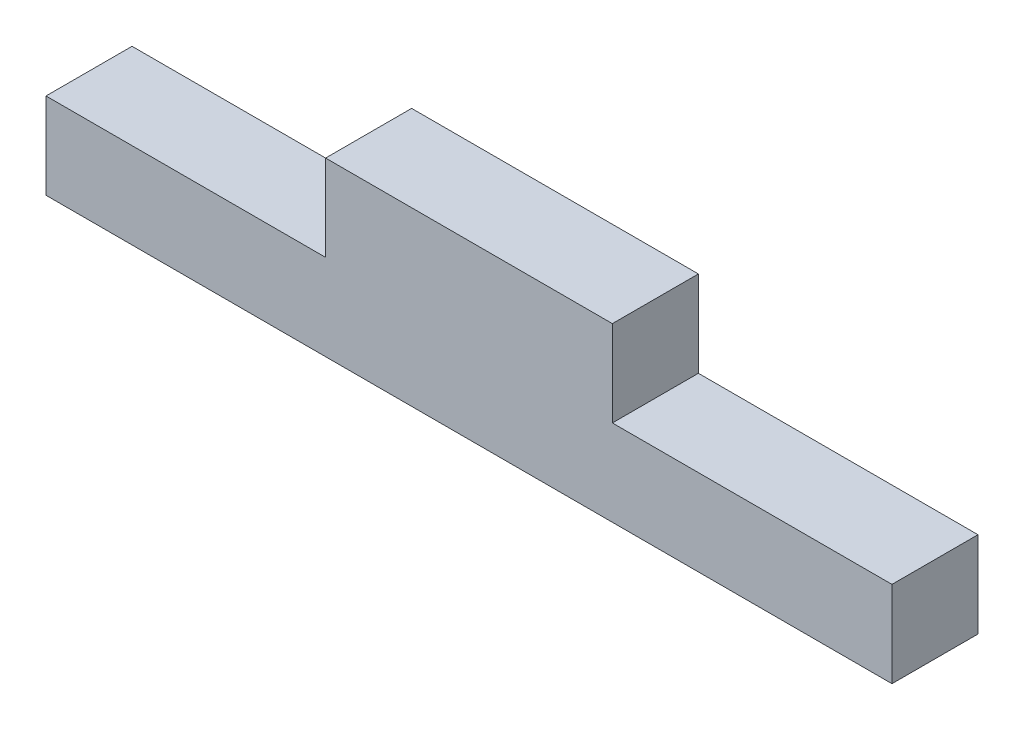
ISO-10303-21;
HEADER;
FILE_DESCRIPTION(('STEP AP214'),'2;1');
FILE_NAME('part.step','',(''),(''),'','','');
FILE_SCHEMA(('AUTOMOTIVE_DESIGN { 1 0 10303 214 1 1 1 1 }'));
ENDSEC;
DATA;
#1=APPLICATION_CONTEXT('core data for automotive mechanical design processes');
#2=APPLICATION_PROTOCOL_DEFINITION('international standard','automotive_design',2000,#1);
#3=PRODUCT_CONTEXT('',#1,'mechanical');
#4=PRODUCT('Part','Part','',(#3));
#5=PRODUCT_RELATED_PRODUCT_CATEGORY('part','',(#4));
#6=PRODUCT_DEFINITION_FORMATION('','',#4);
#7=PRODUCT_DEFINITION_CONTEXT('part definition',#1,'design');
#8=PRODUCT_DEFINITION('design','',#6,#7);
#9=PRODUCT_DEFINITION_SHAPE('','',#8);
#10=(LENGTH_UNIT() NAMED_UNIT(*) SI_UNIT(.MILLI.,.METRE.));
#11=(NAMED_UNIT(*) PLANE_ANGLE_UNIT() SI_UNIT($,.RADIAN.));
#12=(NAMED_UNIT(*) SI_UNIT($,.STERADIAN.) SOLID_ANGLE_UNIT());
#13=UNCERTAINTY_MEASURE_WITH_UNIT(LENGTH_MEASURE(1.E-05),#10,'distance_accuracy_value','');
#14=(GEOMETRIC_REPRESENTATION_CONTEXT(3) GLOBAL_UNCERTAINTY_ASSIGNED_CONTEXT((#13)) GLOBAL_UNIT_ASSIGNED_CONTEXT((#10,
#11,#12)) REPRESENTATION_CONTEXT('',''));
#15=CARTESIAN_POINT('',(0.,0.,0.));
#16=DIRECTION('',(0.,0.,1.));
#17=DIRECTION('',(1.,0.,0.));
#18=AXIS2_PLACEMENT_3D('',#15,#16,#17);
#19=CARTESIAN_POINT('',(0.,5.99999999999999,6.));
#20=DIRECTION('',(0.,-1.,0.));
#21=DIRECTION('',(1.,0.,0.));
#22=AXIS2_PLACEMENT_3D('',#19,#20,#21);
#23=PLANE('',#22);
#24=DIRECTION('',(-1.,0.,0.));
#25=VECTOR('',#24,1.);
#26=CARTESIAN_POINT('',(0.,5.99999999999999,0.));
#27=LINE('',#26,#25);
#28=CARTESIAN_POINT('',(59.,6.,0.));
#29=VERTEX_POINT('',#28);
#30=CARTESIAN_POINT('',(39.5,6.,0.));
#31=VERTEX_POINT('',#30);
#32=EDGE_CURVE('E145',#29,#31,#27,.T.);
#33=ORIENTED_EDGE('',*,*,#32,.T.);
#34=DIRECTION('',(0.,0.,-1.));
#35=VECTOR('',#34,1.);
#36=CARTESIAN_POINT('',(39.5,6.,6.));
#37=LINE('',#36,#35);
#38=CARTESIAN_POINT('',(39.5,6.,6.));
#39=VERTEX_POINT('',#38);
#40=EDGE_CURVE('E11',#39,#31,#37,.T.);
#41=ORIENTED_EDGE('',*,*,#40,.F.);
#42=DIRECTION('',(-1.,0.,0.));
#43=VECTOR('',#42,1.);
#44=CARTESIAN_POINT('',(0.,5.99999999999999,6.));
#45=LINE('',#44,#43);
#46=CARTESIAN_POINT('',(59.,6.,6.));
#47=VERTEX_POINT('',#46);
#48=EDGE_CURVE('E171',#47,#39,#45,.T.);
#49=ORIENTED_EDGE('',*,*,#48,.F.);
#50=DIRECTION('',(0.,0.,-1.));
#51=VECTOR('',#50,1.);
#52=CARTESIAN_POINT('',(59.,6.,6.));
#53=LINE('',#52,#51);
#54=EDGE_CURVE('E144',#47,#29,#53,.T.);
#55=ORIENTED_EDGE('',*,*,#54,.T.);
#56=EDGE_LOOP('',(#33,#41,#49,#55));
#57=FACE_BOUND('',#56,.T.);
#58=ADVANCED_FACE('F41',(#57),#23,.F.);
#59=CARTESIAN_POINT('',(39.5,0.,6.));
#60=DIRECTION('',(-1.,0.,0.));
#61=DIRECTION('',(0.,0.,1.));
#62=AXIS2_PLACEMENT_3D('',#59,#60,#61);
#63=PLANE('',#62);
#64=DIRECTION('',(0.,1.,0.));
#65=VECTOR('',#64,1.);
#66=CARTESIAN_POINT('',(39.5,0.,0.));
#67=LINE('',#66,#65);
#68=CARTESIAN_POINT('',(39.5,12.,0.));
#69=VERTEX_POINT('',#68);
#70=EDGE_CURVE('E149',#31,#69,#67,.T.);
#71=ORIENTED_EDGE('',*,*,#70,.T.);
#72=DIRECTION('',(0.,0.,-1.));
#73=VECTOR('',#72,1.);
#74=CARTESIAN_POINT('',(39.5,12.,6.));
#75=LINE('',#74,#73);
#76=CARTESIAN_POINT('',(39.5,12.,6.));
#77=VERTEX_POINT('',#76);
#78=EDGE_CURVE('E50',#77,#69,#75,.T.);
#79=ORIENTED_EDGE('',*,*,#78,.F.);
#80=DIRECTION('',(0.,1.,0.));
#81=VECTOR('',#80,1.);
#82=CARTESIAN_POINT('',(39.5,0.,6.));
#83=LINE('',#82,#81);
#84=EDGE_CURVE('E100',#39,#77,#83,.T.);
#85=ORIENTED_EDGE('',*,*,#84,.F.);
#86=ORIENTED_EDGE('',*,*,#40,.T.);
#87=EDGE_LOOP('',(#71,#79,#85,#86));
#88=FACE_BOUND('',#87,.T.);
#89=ADVANCED_FACE('F190',(#88),#63,.F.);
#90=CARTESIAN_POINT('',(0.,12.,6.));
#91=DIRECTION('',(0.,1.,0.));
#92=DIRECTION('',(0.,0.,1.));
#93=AXIS2_PLACEMENT_3D('',#90,#91,#92);
#94=PLANE('',#93);
#95=DIRECTION('',(1.,0.,0.));
#96=VECTOR('',#95,1.);
#97=CARTESIAN_POINT('',(0.,12.,0.));
#98=LINE('',#97,#96);
#99=CARTESIAN_POINT('',(19.5,12.,0.));
#100=VERTEX_POINT('',#99);
#101=EDGE_CURVE('E153',#100,#69,#98,.T.);
#102=ORIENTED_EDGE('',*,*,#101,.F.);
#103=DIRECTION('',(0.,0.,-1.));
#104=VECTOR('',#103,1.);
#105=CARTESIAN_POINT('',(19.5,12.,6.));
#106=LINE('',#105,#104);
#107=CARTESIAN_POINT('',(19.5,12.,6.));
#108=VERTEX_POINT('',#107);
#109=EDGE_CURVE('E181',#108,#100,#106,.T.);
#110=ORIENTED_EDGE('',*,*,#109,.F.);
#111=DIRECTION('',(1.,0.,0.));
#112=VECTOR('',#111,1.);
#113=CARTESIAN_POINT('',(0.,12.,6.));
#114=LINE('',#113,#112);
#115=EDGE_CURVE('E189',#108,#77,#114,.T.);
#116=ORIENTED_EDGE('',*,*,#115,.T.);
#117=ORIENTED_EDGE('',*,*,#78,.T.);
#118=EDGE_LOOP('',(#102,#110,#116,#117));
#119=FACE_BOUND('',#118,.T.);
#120=ADVANCED_FACE('F187',(#119),#94,.T.);
#121=CARTESIAN_POINT('',(19.5,0.,6.));
#122=DIRECTION('',(-1.,0.,0.));
#123=DIRECTION('',(0.,0.,1.));
#124=AXIS2_PLACEMENT_3D('',#121,#122,#123);
#125=PLANE('',#124);
#126=DIRECTION('',(0.,1.,0.));
#127=VECTOR('',#126,1.);
#128=CARTESIAN_POINT('',(19.5,0.,0.));
#129=LINE('',#128,#127);
#130=CARTESIAN_POINT('',(19.5,6.,0.));
#131=VERTEX_POINT('',#130);
#132=EDGE_CURVE('E157',#131,#100,#129,.T.);
#133=ORIENTED_EDGE('',*,*,#132,.F.);
#134=DIRECTION('',(0.,0.,-1.));
#135=VECTOR('',#134,1.);
#136=CARTESIAN_POINT('',(19.5,6.,6.));
#137=LINE('',#136,#135);
#138=CARTESIAN_POINT('',(19.5,6.,6.));
#139=VERTEX_POINT('',#138);
#140=EDGE_CURVE('E178',#139,#131,#137,.T.);
#141=ORIENTED_EDGE('',*,*,#140,.F.);
#142=DIRECTION('',(0.,1.,0.));
#143=VECTOR('',#142,1.);
#144=CARTESIAN_POINT('',(19.5,0.,6.));
#145=LINE('',#144,#143);
#146=EDGE_CURVE('E138',#139,#108,#145,.T.);
#147=ORIENTED_EDGE('',*,*,#146,.T.);
#148=ORIENTED_EDGE('',*,*,#109,.T.);
#149=EDGE_LOOP('',(#133,#141,#147,#148));
#150=FACE_BOUND('',#149,.T.);
#151=ADVANCED_FACE('F198',(#150),#125,.T.);
#152=CARTESIAN_POINT('',(0.,6.,6.));
#153=DIRECTION('',(0.,1.,0.));
#154=DIRECTION('',(0.,0.,1.));
#155=AXIS2_PLACEMENT_3D('',#152,#153,#154);
#156=PLANE('',#155);
#157=DIRECTION('',(1.,0.,0.));
#158=VECTOR('',#157,1.);
#159=CARTESIAN_POINT('',(0.,6.,0.));
#160=LINE('',#159,#158);
#161=CARTESIAN_POINT('',(0.,6.,0.));
#162=VERTEX_POINT('',#161);
#163=EDGE_CURVE('E161',#162,#131,#160,.T.);
#164=ORIENTED_EDGE('',*,*,#163,.F.);
#165=DIRECTION('',(0.,0.,-1.));
#166=VECTOR('',#165,1.);
#167=CARTESIAN_POINT('',(0.,6.,6.));
#168=LINE('',#167,#166);
#169=CARTESIAN_POINT('',(0.,6.,6.));
#170=VERTEX_POINT('',#169);
#171=EDGE_CURVE('E123',#170,#162,#168,.T.);
#172=ORIENTED_EDGE('',*,*,#171,.F.);
#173=DIRECTION('',(1.,0.,0.));
#174=VECTOR('',#173,1.);
#175=CARTESIAN_POINT('',(0.,6.,6.));
#176=LINE('',#175,#174);
#177=EDGE_CURVE('E134',#170,#139,#176,.T.);
#178=ORIENTED_EDGE('',*,*,#177,.T.);
#179=ORIENTED_EDGE('',*,*,#140,.T.);
#180=EDGE_LOOP('',(#164,#172,#178,#179));
#181=FACE_BOUND('',#180,.T.);
#182=ADVANCED_FACE('F230',(#181),#156,.T.);
#183=CARTESIAN_POINT('',(0.,0.,6.));
#184=DIRECTION('',(-1.,0.,0.));
#185=DIRECTION('',(0.,0.,1.));
#186=AXIS2_PLACEMENT_3D('',#183,#184,#185);
#187=PLANE('',#186);
#188=DIRECTION('',(0.,1.,0.));
#189=VECTOR('',#188,1.);
#190=CARTESIAN_POINT('',(0.,0.,0.));
#191=LINE('',#190,#189);
#192=CARTESIAN_POINT('',(0.,0.,0.));
#193=VERTEX_POINT('',#192);
#194=EDGE_CURVE('E121',#193,#162,#191,.T.);
#195=ORIENTED_EDGE('',*,*,#194,.F.);
#196=DIRECTION('',(0.,0.,-1.));
#197=VECTOR('',#196,1.);
#198=CARTESIAN_POINT('',(0.,0.,6.));
#199=LINE('',#198,#197);
#200=CARTESIAN_POINT('',(0.,0.,6.));
#201=VERTEX_POINT('',#200);
#202=EDGE_CURVE('E115',#201,#193,#199,.T.);
#203=ORIENTED_EDGE('',*,*,#202,.F.);
#204=DIRECTION('',(0.,1.,0.));
#205=VECTOR('',#204,1.);
#206=CARTESIAN_POINT('',(0.,0.,6.));
#207=LINE('',#206,#205);
#208=EDGE_CURVE('E119',#201,#170,#207,.T.);
#209=ORIENTED_EDGE('',*,*,#208,.T.);
#210=ORIENTED_EDGE('',*,*,#171,.T.);
#211=EDGE_LOOP('',(#195,#203,#209,#210));
#212=FACE_BOUND('',#211,.T.);
#213=ADVANCED_FACE('F117',(#212),#187,.T.);
#214=CARTESIAN_POINT('',(0.,0.,6.));
#215=DIRECTION('',(0.,1.,0.));
#216=DIRECTION('',(0.,0.,1.));
#217=AXIS2_PLACEMENT_3D('',#214,#215,#216);
#218=PLANE('',#217);
#219=DIRECTION('',(1.,0.,0.));
#220=VECTOR('',#219,1.);
#221=CARTESIAN_POINT('',(0.,0.,0.));
#222=LINE('',#221,#220);
#223=CARTESIAN_POINT('',(59.,0.,0.));
#224=VERTEX_POINT('',#223);
#225=EDGE_CURVE('E86',#193,#224,#222,.T.);
#226=ORIENTED_EDGE('',*,*,#225,.T.);
#227=DIRECTION('',(0.,0.,-1.));
#228=VECTOR('',#227,1.);
#229=CARTESIAN_POINT('',(59.,0.,6.));
#230=LINE('',#229,#228);
#231=CARTESIAN_POINT('',(59.,0.,6.));
#232=VERTEX_POINT('',#231);
#233=EDGE_CURVE('E124',#232,#224,#230,.T.);
#234=ORIENTED_EDGE('',*,*,#233,.F.);
#235=DIRECTION('',(1.,0.,0.));
#236=VECTOR('',#235,1.);
#237=CARTESIAN_POINT('',(0.,0.,6.));
#238=LINE('',#237,#236);
#239=EDGE_CURVE('E126',#201,#232,#238,.T.);
#240=ORIENTED_EDGE('',*,*,#239,.F.);
#241=ORIENTED_EDGE('',*,*,#202,.T.);
#242=EDGE_LOOP('',(#226,#234,#240,#241));
#243=FACE_BOUND('',#242,.T.);
#244=ADVANCED_FACE('F127',(#243),#218,.F.);
#245=CARTESIAN_POINT('',(59.,0.,6.));
#246=DIRECTION('',(-1.,0.,0.));
#247=DIRECTION('',(0.,0.,1.));
#248=AXIS2_PLACEMENT_3D('',#245,#246,#247);
#249=PLANE('',#248);
#250=DIRECTION('',(0.,1.,0.));
#251=VECTOR('',#250,1.);
#252=CARTESIAN_POINT('',(59.,0.,0.));
#253=LINE('',#252,#251);
#254=EDGE_CURVE('E92',#224,#29,#253,.T.);
#255=ORIENTED_EDGE('',*,*,#254,.T.);
#256=ORIENTED_EDGE('',*,*,#54,.F.);
#257=DIRECTION('',(0.,1.,0.));
#258=VECTOR('',#257,1.);
#259=CARTESIAN_POINT('',(59.,0.,6.));
#260=LINE('',#259,#258);
#261=EDGE_CURVE('E58',#232,#47,#260,.T.);
#262=ORIENTED_EDGE('',*,*,#261,.F.);
#263=ORIENTED_EDGE('',*,*,#233,.T.);
#264=EDGE_LOOP('',(#255,#256,#262,#263));
#265=FACE_BOUND('',#264,.T.);
#266=ADVANCED_FACE('F209',(#265),#249,.F.);
#267=CARTESIAN_POINT('',(0.,0.,6.));
#268=DIRECTION('',(0.,0.,1.));
#269=DIRECTION('',(1.,0.,0.));
#270=AXIS2_PLACEMENT_3D('',#267,#268,#269);
#271=PLANE('',#270);
#272=ORIENTED_EDGE('',*,*,#48,.T.);
#273=ORIENTED_EDGE('',*,*,#84,.T.);
#274=ORIENTED_EDGE('',*,*,#115,.F.);
#275=ORIENTED_EDGE('',*,*,#146,.F.);
#276=ORIENTED_EDGE('',*,*,#177,.F.);
#277=ORIENTED_EDGE('',*,*,#208,.F.);
#278=ORIENTED_EDGE('',*,*,#239,.T.);
#279=ORIENTED_EDGE('',*,*,#261,.T.);
#280=EDGE_LOOP('',(#272,#273,#274,#275,#276,#277,#278,#279));
#281=FACE_BOUND('',#280,.T.);
#282=ADVANCED_FACE('F131',(#281),#271,.T.);
#283=CARTESIAN_POINT('',(0.,0.,0.));
#284=DIRECTION('',(0.,0.,1.));
#285=DIRECTION('',(1.,0.,0.));
#286=AXIS2_PLACEMENT_3D('',#283,#284,#285);
#287=PLANE('',#286);
#288=ORIENTED_EDGE('',*,*,#32,.F.);
#289=ORIENTED_EDGE('',*,*,#254,.F.);
#290=ORIENTED_EDGE('',*,*,#225,.F.);
#291=ORIENTED_EDGE('',*,*,#194,.T.);
#292=ORIENTED_EDGE('',*,*,#163,.T.);
#293=ORIENTED_EDGE('',*,*,#132,.T.);
#294=ORIENTED_EDGE('',*,*,#101,.T.);
#295=ORIENTED_EDGE('',*,*,#70,.F.);
#296=EDGE_LOOP('',(#288,#289,#290,#291,#292,#293,#294,#295));
#297=FACE_BOUND('',#296,.T.);
#298=ADVANCED_FACE('F194',(#297),#287,.F.);
#299=CLOSED_SHELL('',(#58,#89,#120,#151,#182,#213,#244,#266,#282,#298));
#300=MANIFOLD_SOLID_BREP('B2',#299);
#301=ADVANCED_BREP_SHAPE_REPRESENTATION('',(#18,#300),#14);
#302=SHAPE_DEFINITION_REPRESENTATION(#9,#301);
ENDSEC;
END-ISO-10303-21;
